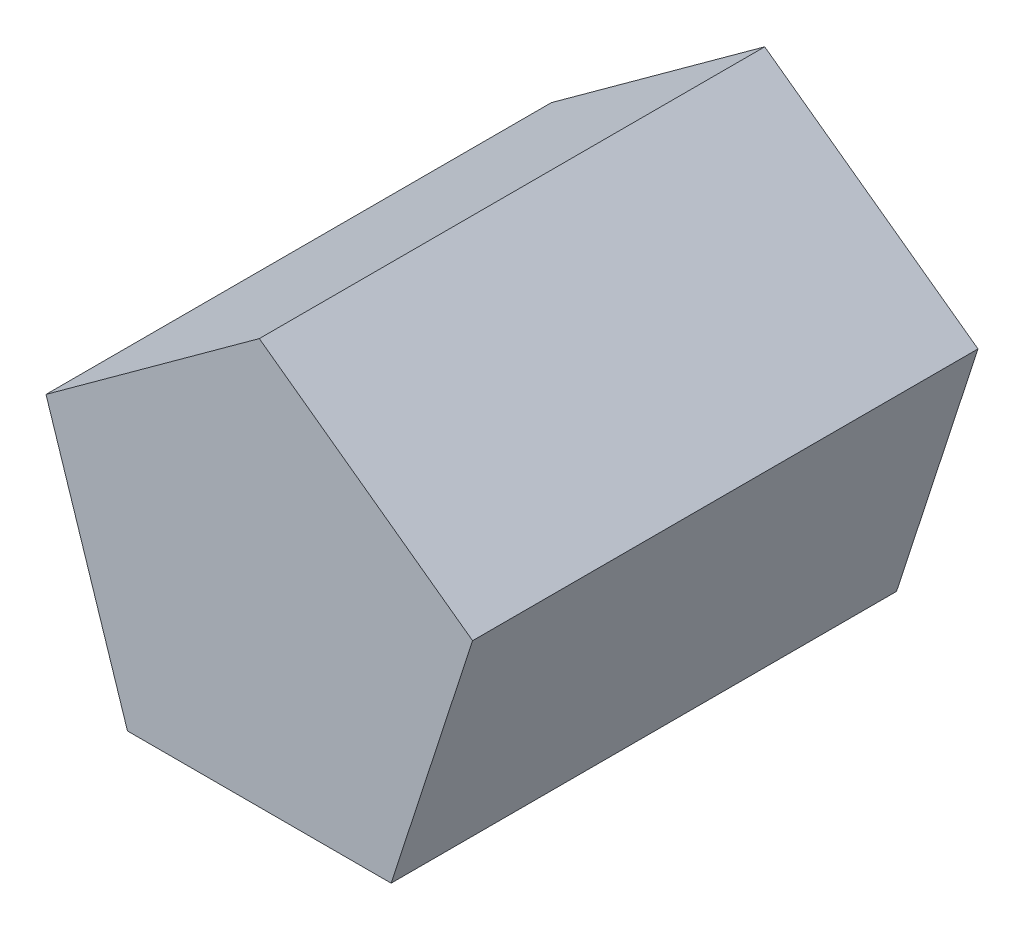
ISO-10303-21;
HEADER;
FILE_DESCRIPTION(('STEP AP214'),'2;1');
FILE_NAME('part.step','',(''),(''),'','','');
FILE_SCHEMA(('AUTOMOTIVE_DESIGN { 1 0 10303 214 1 1 1 1 }'));
ENDSEC;
DATA;
#1=APPLICATION_CONTEXT('core data for automotive mechanical design processes');
#2=APPLICATION_PROTOCOL_DEFINITION('international standard','automotive_design',2000,#1);
#3=PRODUCT_CONTEXT('',#1,'mechanical');
#4=PRODUCT('Part','Part','',(#3));
#5=PRODUCT_RELATED_PRODUCT_CATEGORY('part','',(#4));
#6=PRODUCT_DEFINITION_FORMATION('','',#4);
#7=PRODUCT_DEFINITION_CONTEXT('part definition',#1,'design');
#8=PRODUCT_DEFINITION('design','',#6,#7);
#9=PRODUCT_DEFINITION_SHAPE('','',#8);
#10=(LENGTH_UNIT() NAMED_UNIT(*) SI_UNIT(.MILLI.,.METRE.));
#11=(NAMED_UNIT(*) PLANE_ANGLE_UNIT() SI_UNIT($,.RADIAN.));
#12=(NAMED_UNIT(*) SI_UNIT($,.STERADIAN.) SOLID_ANGLE_UNIT());
#13=UNCERTAINTY_MEASURE_WITH_UNIT(LENGTH_MEASURE(1.E-05),#10,'distance_accuracy_value','');
#14=(GEOMETRIC_REPRESENTATION_CONTEXT(3) GLOBAL_UNCERTAINTY_ASSIGNED_CONTEXT((#13)) GLOBAL_UNIT_ASSIGNED_CONTEXT((#10,
#11,#12)) REPRESENTATION_CONTEXT('',''));
#15=CARTESIAN_POINT('',(0.,0.,0.));
#16=DIRECTION('',(0.,0.,1.));
#17=DIRECTION('',(1.,0.,0.));
#18=AXIS2_PLACEMENT_3D('',#15,#16,#17);
#19=CARTESIAN_POINT('',(-41.7327529127656,-57.4402066006213,160.));
#20=DIRECTION('',(0.,1.,0.));
#21=DIRECTION('',(0.,0.,1.));
#22=AXIS2_PLACEMENT_3D('',#19,#20,#21);
#23=PLANE('',#22);
#24=DIRECTION('',(1.,0.,0.));
#25=VECTOR('',#24,1.);
#26=CARTESIAN_POINT('',(-41.7327529127656,-57.4402066006213,0.));
#27=LINE('',#26,#25);
#28=CARTESIAN_POINT('',(-41.7327529127656,-57.4402066006213,0.));
#29=VERTEX_POINT('',#28);
#30=CARTESIAN_POINT('',(41.7327529127656,-57.4402066006213,0.));
#31=VERTEX_POINT('',#30);
#32=EDGE_CURVE('E107',#29,#31,#27,.T.);
#33=ORIENTED_EDGE('',*,*,#32,.T.);
#34=DIRECTION('',(0.,0.,-1.));
#35=VECTOR('',#34,1.);
#36=CARTESIAN_POINT('',(41.7327529127656,-57.4402066006213,160.));
#37=LINE('',#36,#35);
#38=CARTESIAN_POINT('',(41.7327529127656,-57.4402066006213,160.));
#39=VERTEX_POINT('',#38);
#40=EDGE_CURVE('E11',#39,#31,#37,.T.);
#41=ORIENTED_EDGE('',*,*,#40,.F.);
#42=DIRECTION('',(1.,0.,0.));
#43=VECTOR('',#42,1.);
#44=CARTESIAN_POINT('',(-41.7327529127656,-57.4402066006213,160.));
#45=LINE('',#44,#43);
#46=CARTESIAN_POINT('',(-41.7327529127656,-57.4402066006213,160.));
#47=VERTEX_POINT('',#46);
#48=EDGE_CURVE('E115',#47,#39,#45,.T.);
#49=ORIENTED_EDGE('',*,*,#48,.F.);
#50=DIRECTION('',(0.,0.,-1.));
#51=VECTOR('',#50,1.);
#52=CARTESIAN_POINT('',(-41.7327529127656,-57.4402066006213,160.));
#53=LINE('',#52,#51);
#54=EDGE_CURVE('E103',#47,#29,#53,.T.);
#55=ORIENTED_EDGE('',*,*,#54,.T.);
#56=EDGE_LOOP('',(#33,#41,#49,#55));
#57=FACE_BOUND('',#56,.T.);
#58=ADVANCED_FACE('F33',(#57),#23,.F.);
#59=CARTESIAN_POINT('',(41.7327529127656,-57.4402066006213,160.));
#60=DIRECTION('',(-0.951056516295154,0.309016994374947,0.));
#61=DIRECTION('',(-0.309016994374947,-0.951056516295154,0.));
#62=AXIS2_PLACEMENT_3D('',#59,#60,#61);
#63=PLANE('',#62);
#64=DIRECTION('',(0.309016994374947,0.951056516295154,0.));
#65=VECTOR('',#64,1.);
#66=CARTESIAN_POINT('',(41.7327529127656,-57.4402066006213,0.));
#67=LINE('',#66,#65);
#68=CARTESIAN_POINT('',(67.5250126569559,21.9402066006213,0.));
#69=VERTEX_POINT('',#68);
#70=EDGE_CURVE('E110',#31,#69,#67,.T.);
#71=ORIENTED_EDGE('',*,*,#70,.T.);
#72=DIRECTION('',(0.,0.,-1.));
#73=VECTOR('',#72,1.);
#74=CARTESIAN_POINT('',(67.5250126569559,21.9402066006213,160.));
#75=LINE('',#74,#73);
#76=CARTESIAN_POINT('',(67.5250126569559,21.9402066006213,160.));
#77=VERTEX_POINT('',#76);
#78=EDGE_CURVE('E41',#77,#69,#75,.T.);
#79=ORIENTED_EDGE('',*,*,#78,.F.);
#80=DIRECTION('',(0.309016994374947,0.951056516295154,0.));
#81=VECTOR('',#80,1.);
#82=CARTESIAN_POINT('',(41.7327529127656,-57.4402066006213,160.));
#83=LINE('',#82,#81);
#84=EDGE_CURVE('E83',#39,#77,#83,.T.);
#85=ORIENTED_EDGE('',*,*,#84,.F.);
#86=ORIENTED_EDGE('',*,*,#40,.T.);
#87=EDGE_LOOP('',(#71,#79,#85,#86));
#88=FACE_BOUND('',#87,.T.);
#89=ADVANCED_FACE('F134',(#88),#63,.F.);
#90=CARTESIAN_POINT('',(67.5250126569559,21.9402066006213,160.));
#91=DIRECTION('',(-0.587785252292473,-0.809016994374948,0.));
#92=DIRECTION('',(0.809016994374948,-0.587785252292473,0.));
#93=AXIS2_PLACEMENT_3D('',#90,#91,#92);
#94=PLANE('',#93);
#95=DIRECTION('',(-0.809016994374948,0.587785252292473,0.));
#96=VECTOR('',#95,1.);
#97=CARTESIAN_POINT('',(67.5250126569559,21.9402066006213,0.));
#98=LINE('',#97,#96);
#99=CARTESIAN_POINT('',(0.,71.,0.));
#100=VERTEX_POINT('',#99);
#101=EDGE_CURVE('E98',#69,#100,#98,.T.);
#102=ORIENTED_EDGE('',*,*,#101,.T.);
#103=DIRECTION('',(0.,0.,-1.));
#104=VECTOR('',#103,1.);
#105=CARTESIAN_POINT('',(0.,71.,160.));
#106=LINE('',#105,#104);
#107=CARTESIAN_POINT('',(0.,71.,160.));
#108=VERTEX_POINT('',#107);
#109=EDGE_CURVE('E95',#108,#100,#106,.T.);
#110=ORIENTED_EDGE('',*,*,#109,.F.);
#111=DIRECTION('',(-0.809016994374948,0.587785252292473,0.));
#112=VECTOR('',#111,1.);
#113=CARTESIAN_POINT('',(67.5250126569559,21.9402066006213,160.));
#114=LINE('',#113,#112);
#115=EDGE_CURVE('E87',#77,#108,#114,.T.);
#116=ORIENTED_EDGE('',*,*,#115,.F.);
#117=ORIENTED_EDGE('',*,*,#78,.T.);
#118=EDGE_LOOP('',(#102,#110,#116,#117));
#119=FACE_BOUND('',#118,.T.);
#120=ADVANCED_FACE('F96',(#119),#94,.F.);
#121=CARTESIAN_POINT('',(0.,71.,160.));
#122=DIRECTION('',(0.587785252292473,-0.809016994374947,0.));
#123=DIRECTION('',(0.809016994374947,0.587785252292473,0.));
#124=AXIS2_PLACEMENT_3D('',#121,#122,#123);
#125=PLANE('',#124);
#126=DIRECTION('',(-0.809016994374947,-0.587785252292473,0.));
#127=VECTOR('',#126,1.);
#128=CARTESIAN_POINT('',(0.,71.,0.));
#129=LINE('',#128,#127);
#130=CARTESIAN_POINT('',(-67.5250126569559,21.9402066006212,0.));
#131=VERTEX_POINT('',#130);
#132=EDGE_CURVE('E69',#100,#131,#129,.T.);
#133=ORIENTED_EDGE('',*,*,#132,.T.);
#134=DIRECTION('',(0.,0.,-1.));
#135=VECTOR('',#134,1.);
#136=CARTESIAN_POINT('',(-67.5250126569559,21.9402066006212,160.));
#137=LINE('',#136,#135);
#138=CARTESIAN_POINT('',(-67.5250126569559,21.9402066006212,160.));
#139=VERTEX_POINT('',#138);
#140=EDGE_CURVE('E99',#139,#131,#137,.T.);
#141=ORIENTED_EDGE('',*,*,#140,.F.);
#142=DIRECTION('',(-0.809016994374947,-0.587785252292473,0.));
#143=VECTOR('',#142,1.);
#144=CARTESIAN_POINT('',(0.,71.,160.));
#145=LINE('',#144,#143);
#146=EDGE_CURVE('E91',#108,#139,#145,.T.);
#147=ORIENTED_EDGE('',*,*,#146,.F.);
#148=ORIENTED_EDGE('',*,*,#109,.T.);
#149=EDGE_LOOP('',(#133,#141,#147,#148));
#150=FACE_BOUND('',#149,.T.);
#151=ADVANCED_FACE('F101',(#150),#125,.F.);
#152=CARTESIAN_POINT('',(-67.5250126569559,21.9402066006212,160.));
#153=DIRECTION('',(0.951056516295154,0.309016994374948,0.));
#154=DIRECTION('',(-0.309016994374948,0.951056516295154,0.));
#155=AXIS2_PLACEMENT_3D('',#152,#153,#154);
#156=PLANE('',#155);
#157=DIRECTION('',(0.309016994374948,-0.951056516295154,0.));
#158=VECTOR('',#157,1.);
#159=CARTESIAN_POINT('',(-67.5250126569559,21.9402066006212,0.));
#160=LINE('',#159,#158);
#161=EDGE_CURVE('E75',#131,#29,#160,.T.);
#162=ORIENTED_EDGE('',*,*,#161,.T.);
#163=ORIENTED_EDGE('',*,*,#54,.F.);
#164=DIRECTION('',(0.309016994374948,-0.951056516295154,0.));
#165=VECTOR('',#164,1.);
#166=CARTESIAN_POINT('',(-67.5250126569559,21.9402066006212,160.));
#167=LINE('',#166,#165);
#168=EDGE_CURVE('E49',#139,#47,#167,.T.);
#169=ORIENTED_EDGE('',*,*,#168,.F.);
#170=ORIENTED_EDGE('',*,*,#140,.T.);
#171=EDGE_LOOP('',(#162,#163,#169,#170));
#172=FACE_BOUND('',#171,.T.);
#173=ADVANCED_FACE('F123',(#172),#156,.F.);
#174=CARTESIAN_POINT('',(0.,0.,160.));
#175=DIRECTION('',(0.,0.,1.));
#176=DIRECTION('',(1.,0.,0.));
#177=AXIS2_PLACEMENT_3D('',#174,#175,#176);
#178=PLANE('',#177);
#179=ORIENTED_EDGE('',*,*,#48,.T.);
#180=ORIENTED_EDGE('',*,*,#84,.T.);
#181=ORIENTED_EDGE('',*,*,#115,.T.);
#182=ORIENTED_EDGE('',*,*,#146,.T.);
#183=ORIENTED_EDGE('',*,*,#168,.T.);
#184=EDGE_LOOP('',(#179,#180,#181,#182,#183));
#185=FACE_BOUND('',#184,.T.);
#186=ADVANCED_FACE('F89',(#185),#178,.T.);
#187=CARTESIAN_POINT('',(0.,0.,0.));
#188=DIRECTION('',(0.,0.,1.));
#189=DIRECTION('',(1.,0.,0.));
#190=AXIS2_PLACEMENT_3D('',#187,#188,#189);
#191=PLANE('',#190);
#192=ORIENTED_EDGE('',*,*,#32,.F.);
#193=ORIENTED_EDGE('',*,*,#161,.F.);
#194=ORIENTED_EDGE('',*,*,#132,.F.);
#195=ORIENTED_EDGE('',*,*,#101,.F.);
#196=ORIENTED_EDGE('',*,*,#70,.F.);
#197=EDGE_LOOP('',(#192,#193,#194,#195,#196));
#198=FACE_BOUND('',#197,.T.);
#199=ADVANCED_FACE('F119',(#198),#191,.F.);
#200=CLOSED_SHELL('',(#58,#89,#120,#151,#173,#186,#199));
#201=MANIFOLD_SOLID_BREP('B2',#200);
#202=ADVANCED_BREP_SHAPE_REPRESENTATION('',(#18,#201),#14);
#203=SHAPE_DEFINITION_REPRESENTATION(#9,#202);
ENDSEC;
END-ISO-10303-21;
